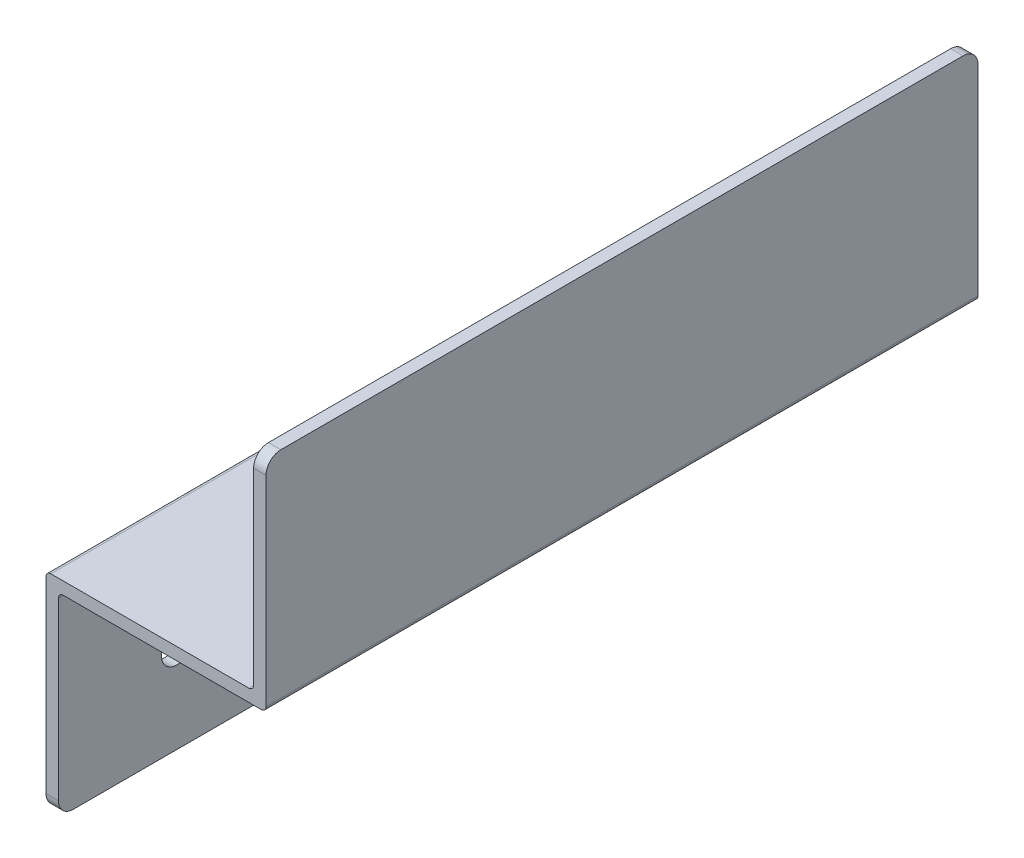
ISO-10303-21;
HEADER;
FILE_DESCRIPTION(('STEP AP214'),'2;1');
FILE_NAME('part.step','',(''),(''),'','','');
FILE_SCHEMA(('AUTOMOTIVE_DESIGN { 1 0 10303 214 1 1 1 1 }'));
ENDSEC;
DATA;
#1=APPLICATION_CONTEXT('core data for automotive mechanical design processes');
#2=APPLICATION_PROTOCOL_DEFINITION('international standard','automotive_design',2000,#1);
#3=PRODUCT_CONTEXT('',#1,'mechanical');
#4=PRODUCT('Part','Part','',(#3));
#5=PRODUCT_RELATED_PRODUCT_CATEGORY('part','',(#4));
#6=PRODUCT_DEFINITION_FORMATION('','',#4);
#7=PRODUCT_DEFINITION_CONTEXT('part definition',#1,'design');
#8=PRODUCT_DEFINITION('design','',#6,#7);
#9=PRODUCT_DEFINITION_SHAPE('','',#8);
#10=(LENGTH_UNIT() NAMED_UNIT(*) SI_UNIT(.MILLI.,.METRE.));
#11=(NAMED_UNIT(*) PLANE_ANGLE_UNIT() SI_UNIT($,.RADIAN.));
#12=(NAMED_UNIT(*) SI_UNIT($,.STERADIAN.) SOLID_ANGLE_UNIT());
#13=UNCERTAINTY_MEASURE_WITH_UNIT(LENGTH_MEASURE(1.E-05),#10,'distance_accuracy_value','');
#14=(GEOMETRIC_REPRESENTATION_CONTEXT(3) GLOBAL_UNCERTAINTY_ASSIGNED_CONTEXT((#13)) GLOBAL_UNIT_ASSIGNED_CONTEXT((#10,
#11,#12)) REPRESENTATION_CONTEXT('',''));
#15=CARTESIAN_POINT('',(0.,0.,0.));
#16=DIRECTION('',(0.,0.,1.));
#17=DIRECTION('',(1.,0.,0.));
#18=AXIS2_PLACEMENT_3D('',#15,#16,#17);
#19=CARTESIAN_POINT('',(1.0414,43.4086,274.86864));
#20=DIRECTION('',(0.,0.,-1.));
#21=DIRECTION('',(-1.,0.,0.));
#22=AXIS2_PLACEMENT_3D('',#19,#20,#21);
#23=CYLINDRICAL_SURFACE('',#22,1.0414);
#24=DIRECTION('',(0.,0.,1.));
#25=VECTOR('',#24,1.);
#26=CARTESIAN_POINT('',(1.0414,44.45,-76.2));
#27=LINE('',#26,#25);
#28=CARTESIAN_POINT('',(1.0414,44.45,-76.2));
#29=VERTEX_POINT('',#28);
#30=CARTESIAN_POINT('',(1.0414,44.45,76.2));
#31=VERTEX_POINT('',#30);
#32=EDGE_CURVE('E132',#29,#31,#27,.T.);
#33=ORIENTED_EDGE('',*,*,#32,.F.);
#34=CARTESIAN_POINT('',(1.0414,43.4086,-76.2));
#35=DIRECTION('',(0.,0.,-1.));
#36=DIRECTION('',(-1.,0.,0.));
#37=AXIS2_PLACEMENT_3D('',#34,#35,#36);
#38=CIRCLE('',#37,1.0414);
#39=CARTESIAN_POINT('',(0.,43.4086,-76.2));
#40=VERTEX_POINT('',#39);
#41=EDGE_CURVE('E137',#29,#40,#38,.F.);
#42=ORIENTED_EDGE('',*,*,#41,.T.);
#43=DIRECTION('',(0.,0.,1.));
#44=VECTOR('',#43,1.);
#45=CARTESIAN_POINT('',(0.,43.4086,-76.2));
#46=LINE('',#45,#44);
#47=CARTESIAN_POINT('',(0.,43.4086,76.2));
#48=VERTEX_POINT('',#47);
#49=EDGE_CURVE('E135',#48,#40,#46,.F.);
#50=ORIENTED_EDGE('',*,*,#49,.F.);
#51=CARTESIAN_POINT('',(1.0414,43.4086,76.2));
#52=DIRECTION('',(0.,0.,-1.));
#53=DIRECTION('',(-1.,0.,0.));
#54=AXIS2_PLACEMENT_3D('',#51,#52,#53);
#55=CIRCLE('',#54,1.0414);
#56=EDGE_CURVE('E20',#48,#31,#55,.T.);
#57=ORIENTED_EDGE('',*,*,#56,.T.);
#58=EDGE_LOOP('',(#33,#42,#50,#57));
#59=FACE_BOUND('',#58,.T.);
#60=ADVANCED_FACE('F17',(#59),#23,.T.);
#61=CARTESIAN_POINT('',(0.,0.,-76.2));
#62=DIRECTION('',(0.,-1.,0.));
#63=DIRECTION('',(0.,0.,-1.));
#64=AXIS2_PLACEMENT_3D('',#61,#62,#63);
#65=PLANE('',#64);
#66=DIRECTION('',(0.,0.,-1.));
#67=VECTOR('',#66,1.);
#68=CARTESIAN_POINT('',(2.65684,0.,-76.2));
#69=LINE('',#68,#67);
#70=CARTESIAN_POINT('',(2.65684,0.,73.025));
#71=VERTEX_POINT('',#70);
#72=CARTESIAN_POINT('',(2.65684,0.,-73.025));
#73=VERTEX_POINT('',#72);
#74=EDGE_CURVE('E173',#71,#73,#69,.T.);
#75=ORIENTED_EDGE('',*,*,#74,.F.);
#76=DIRECTION('',(1.,0.,0.));
#77=VECTOR('',#76,1.);
#78=CARTESIAN_POINT('',(-61.408476624,0.,73.025));
#79=LINE('',#78,#77);
#80=CARTESIAN_POINT('',(0.,0.,73.025));
#81=VERTEX_POINT('',#80);
#82=EDGE_CURVE('E191',#81,#71,#79,.T.);
#83=ORIENTED_EDGE('',*,*,#82,.F.);
#84=DIRECTION('',(0.,0.,1.));
#85=VECTOR('',#84,1.);
#86=CARTESIAN_POINT('',(0.,0.,-76.2));
#87=LINE('',#86,#85);
#88=CARTESIAN_POINT('',(0.,0.,-73.025));
#89=VERTEX_POINT('',#88);
#90=EDGE_CURVE('E186',#89,#81,#87,.T.);
#91=ORIENTED_EDGE('',*,*,#90,.F.);
#92=DIRECTION('',(-1.,0.,0.));
#93=VECTOR('',#92,1.);
#94=CARTESIAN_POINT('',(108.515316624,0.,-73.025));
#95=LINE('',#94,#93);
#96=EDGE_CURVE('E200',#73,#89,#95,.T.);
#97=ORIENTED_EDGE('',*,*,#96,.F.);
#98=EDGE_LOOP('',(#75,#83,#91,#97));
#99=FACE_BOUND('',#98,.T.);
#100=ADVANCED_FACE('F465',(#99),#65,.T.);
#101=CARTESIAN_POINT('',(2.65684,19.05,-50.8));
#102=DIRECTION('',(1.,0.,0.));
#103=DIRECTION('',(0.,0.,-1.));
#104=AXIS2_PLACEMENT_3D('',#101,#102,#103);
#105=CYLINDRICAL_SURFACE('',#104,3.3655);
#106=CARTESIAN_POINT('',(0.,19.05,-50.8));
#107=DIRECTION('',(1.,0.,0.));
#108=DIRECTION('',(0.,0.,-1.));
#109=AXIS2_PLACEMENT_3D('',#106,#107,#108);
#110=CIRCLE('',#109,3.3655);
#111=CARTESIAN_POINT('',(0.,19.05,-54.1655));
#112=VERTEX_POINT('',#111);
#113=EDGE_CURVE('E234',#112,#112,#110,.T.);
#114=ORIENTED_EDGE('',*,*,#113,.F.);
#115=EDGE_LOOP('',(#114));
#116=FACE_BOUND('',#115,.T.);
#117=CARTESIAN_POINT('',(2.65684,19.05,-50.8));
#118=DIRECTION('',(1.,0.,0.));
#119=DIRECTION('',(0.,0.,-1.));
#120=AXIS2_PLACEMENT_3D('',#117,#118,#119);
#121=CIRCLE('',#120,3.3655);
#122=CARTESIAN_POINT('',(2.65684,19.05,-54.1655));
#123=VERTEX_POINT('',#122);
#124=EDGE_CURVE('E223',#123,#123,#121,.F.);
#125=ORIENTED_EDGE('',*,*,#124,.F.);
#126=EDGE_LOOP('',(#125));
#127=FACE_BOUND('',#126,.T.);
#128=ADVANCED_FACE('F455',(#116,#127),#105,.F.);
#129=CARTESIAN_POINT('',(2.65684,19.05,50.8));
#130=DIRECTION('',(1.,0.,0.));
#131=DIRECTION('',(0.,0.,-1.));
#132=AXIS2_PLACEMENT_3D('',#129,#130,#131);
#133=CYLINDRICAL_SURFACE('',#132,3.3655);
#134=CARTESIAN_POINT('',(0.,19.05,50.8));
#135=DIRECTION('',(1.,0.,0.));
#136=DIRECTION('',(0.,0.,-1.));
#137=AXIS2_PLACEMENT_3D('',#134,#135,#136);
#138=CIRCLE('',#137,3.3655);
#139=CARTESIAN_POINT('',(0.,19.05,47.4345));
#140=VERTEX_POINT('',#139);
#141=EDGE_CURVE('E202',#140,#140,#138,.T.);
#142=ORIENTED_EDGE('',*,*,#141,.F.);
#143=EDGE_LOOP('',(#142));
#144=FACE_BOUND('',#143,.T.);
#145=CARTESIAN_POINT('',(2.65684,19.05,50.8));
#146=DIRECTION('',(1.,0.,0.));
#147=DIRECTION('',(0.,0.,-1.));
#148=AXIS2_PLACEMENT_3D('',#145,#146,#147);
#149=CIRCLE('',#148,3.3655);
#150=CARTESIAN_POINT('',(2.65684,19.05,47.4345));
#151=VERTEX_POINT('',#150);
#152=EDGE_CURVE('E172',#151,#151,#149,.F.);
#153=ORIENTED_EDGE('',*,*,#152,.F.);
#154=EDGE_LOOP('',(#153));
#155=FACE_BOUND('',#154,.T.);
#156=ADVANCED_FACE('F446',(#144,#155),#133,.F.);
#157=CARTESIAN_POINT('',(3.69824,40.75176,-274.86864));
#158=DIRECTION('',(0.,0.,1.));
#159=DIRECTION('',(1.,0.,0.));
#160=AXIS2_PLACEMENT_3D('',#157,#158,#159);
#161=CYLINDRICAL_SURFACE('',#160,1.0414);
#162=DIRECTION('',(0.,0.,-1.));
#163=VECTOR('',#162,1.);
#164=CARTESIAN_POINT('',(2.65684,40.75176,-76.2));
#165=LINE('',#164,#163);
#166=CARTESIAN_POINT('',(2.65684,40.75176,-76.2));
#167=VERTEX_POINT('',#166);
#168=CARTESIAN_POINT('',(2.65684,40.75176,76.2));
#169=VERTEX_POINT('',#168);
#170=EDGE_CURVE('E182',#167,#169,#165,.F.);
#171=ORIENTED_EDGE('',*,*,#170,.F.);
#172=CARTESIAN_POINT('',(3.69824,40.75176,-76.2));
#173=DIRECTION('',(0.,0.,1.));
#174=DIRECTION('',(1.,0.,0.));
#175=AXIS2_PLACEMENT_3D('',#172,#173,#174);
#176=CIRCLE('',#175,1.0414);
#177=CARTESIAN_POINT('',(3.69824,41.79316,-76.2));
#178=VERTEX_POINT('',#177);
#179=EDGE_CURVE('E243',#178,#167,#176,.T.);
#180=ORIENTED_EDGE('',*,*,#179,.F.);
#181=DIRECTION('',(0.,0.,-1.));
#182=VECTOR('',#181,1.);
#183=CARTESIAN_POINT('',(3.69824,41.79316,-76.2));
#184=LINE('',#183,#182);
#185=CARTESIAN_POINT('',(3.69824,41.79316,76.2));
#186=VERTEX_POINT('',#185);
#187=EDGE_CURVE('E169',#186,#178,#184,.T.);
#188=ORIENTED_EDGE('',*,*,#187,.F.);
#189=CARTESIAN_POINT('',(3.69824,40.75176,76.2));
#190=DIRECTION('',(0.,0.,1.));
#191=DIRECTION('',(1.,0.,0.));
#192=AXIS2_PLACEMENT_3D('',#189,#190,#191);
#193=CIRCLE('',#192,1.0414);
#194=EDGE_CURVE('E241',#169,#186,#193,.F.);
#195=ORIENTED_EDGE('',*,*,#194,.F.);
#196=EDGE_LOOP('',(#171,#180,#188,#195));
#197=FACE_BOUND('',#196,.T.);
#198=ADVANCED_FACE('F272',(#197),#161,.F.);
#199=CARTESIAN_POINT('',(43.4086,45.4914,-274.86864));
#200=DIRECTION('',(0.,0.,1.));
#201=DIRECTION('',(1.,0.,0.));
#202=AXIS2_PLACEMENT_3D('',#199,#200,#201);
#203=CYLINDRICAL_SURFACE('',#202,1.0414);
#204=DIRECTION('',(0.,0.,1.));
#205=VECTOR('',#204,1.);
#206=CARTESIAN_POINT('',(44.45,45.4914,-76.2));
#207=LINE('',#206,#205);
#208=CARTESIAN_POINT('',(44.45,45.4914,-76.2));
#209=VERTEX_POINT('',#208);
#210=CARTESIAN_POINT('',(44.45,45.4914,76.2));
#211=VERTEX_POINT('',#210);
#212=EDGE_CURVE('E156',#209,#211,#207,.T.);
#213=ORIENTED_EDGE('',*,*,#212,.F.);
#214=CARTESIAN_POINT('',(43.4086,45.4914,-76.2));
#215=DIRECTION('',(0.,0.,1.));
#216=DIRECTION('',(1.,0.,0.));
#217=AXIS2_PLACEMENT_3D('',#214,#215,#216);
#218=CIRCLE('',#217,1.0414);
#219=CARTESIAN_POINT('',(43.4086,44.45,-76.2));
#220=VERTEX_POINT('',#219);
#221=EDGE_CURVE('E239',#220,#209,#218,.T.);
#222=ORIENTED_EDGE('',*,*,#221,.F.);
#223=DIRECTION('',(0.,0.,1.));
#224=VECTOR('',#223,1.);
#225=CARTESIAN_POINT('',(43.4086,44.45,-76.2));
#226=LINE('',#225,#224);
#227=CARTESIAN_POINT('',(43.4086,44.45,76.2));
#228=VERTEX_POINT('',#227);
#229=EDGE_CURVE('E145',#228,#220,#226,.F.);
#230=ORIENTED_EDGE('',*,*,#229,.F.);
#231=CARTESIAN_POINT('',(43.4086,45.4914,76.2));
#232=DIRECTION('',(0.,0.,1.));
#233=DIRECTION('',(1.,0.,0.));
#234=AXIS2_PLACEMENT_3D('',#231,#232,#233);
#235=CIRCLE('',#234,1.0414);
#236=EDGE_CURVE('E149',#211,#228,#235,.F.);
#237=ORIENTED_EDGE('',*,*,#236,.F.);
#238=EDGE_LOOP('',(#213,#222,#230,#237));
#239=FACE_BOUND('',#238,.T.);
#240=ADVANCED_FACE('F427',(#239),#203,.F.);
#241=CARTESIAN_POINT('',(-61.408476624,3.175,73.025));
#242=DIRECTION('',(1.,0.,0.));
#243=DIRECTION('',(0.,0.,-1.));
#244=AXIS2_PLACEMENT_3D('',#241,#242,#243);
#245=CYLINDRICAL_SURFACE('',#244,3.175);
#246=ORIENTED_EDGE('',*,*,#82,.T.);
#247=CARTESIAN_POINT('',(2.65684,3.175,73.025));
#248=DIRECTION('',(1.,0.,0.));
#249=DIRECTION('',(0.,0.,-1.));
#250=AXIS2_PLACEMENT_3D('',#247,#248,#249);
#251=CIRCLE('',#250,3.175);
#252=CARTESIAN_POINT('',(2.65684,3.175,76.2));
#253=VERTEX_POINT('',#252);
#254=EDGE_CURVE('E185',#253,#71,#251,.T.);
#255=ORIENTED_EDGE('',*,*,#254,.F.);
#256=DIRECTION('',(1.,0.,0.));
#257=VECTOR('',#256,1.);
#258=CARTESIAN_POINT('',(0.,3.175,76.2));
#259=LINE('',#258,#257);
#260=CARTESIAN_POINT('',(0.,3.175,76.2));
#261=VERTEX_POINT('',#260);
#262=EDGE_CURVE('E154',#261,#253,#259,.T.);
#263=ORIENTED_EDGE('',*,*,#262,.F.);
#264=CARTESIAN_POINT('',(0.,3.175,73.025));
#265=DIRECTION('',(1.,0.,0.));
#266=DIRECTION('',(0.,0.,-1.));
#267=AXIS2_PLACEMENT_3D('',#264,#265,#266);
#268=CIRCLE('',#267,3.175);
#269=EDGE_CURVE('E189',#81,#261,#268,.F.);
#270=ORIENTED_EDGE('',*,*,#269,.F.);
#271=EDGE_LOOP('',(#246,#255,#263,#270));
#272=FACE_BOUND('',#271,.T.);
#273=ADVANCED_FACE('F418',(#272),#245,.T.);
#274=CARTESIAN_POINT('',(44.45,44.45,-76.2));
#275=DIRECTION('',(0.,1.,0.));
#276=DIRECTION('',(0.,0.,1.));
#277=AXIS2_PLACEMENT_3D('',#274,#275,#276);
#278=PLANE('',#277);
#279=DIRECTION('',(1.,0.,0.));
#280=VECTOR('',#279,1.);
#281=CARTESIAN_POINT('',(0.,44.45,-76.2));
#282=LINE('',#281,#280);
#283=EDGE_CURVE('E144',#220,#29,#282,.F.);
#284=ORIENTED_EDGE('',*,*,#283,.T.);
#285=ORIENTED_EDGE('',*,*,#32,.T.);
#286=DIRECTION('',(1.,0.,0.));
#287=VECTOR('',#286,1.);
#288=CARTESIAN_POINT('',(0.,44.45,76.2));
#289=LINE('',#288,#287);
#290=EDGE_CURVE('E142',#228,#31,#289,.F.);
#291=ORIENTED_EDGE('',*,*,#290,.F.);
#292=ORIENTED_EDGE('',*,*,#229,.T.);
#293=EDGE_LOOP('',(#284,#285,#291,#292));
#294=FACE_BOUND('',#293,.T.);
#295=ADVANCED_FACE('F140',(#294),#278,.T.);
#296=CARTESIAN_POINT('',(0.,44.45,-76.2));
#297=DIRECTION('',(-1.,0.,0.));
#298=DIRECTION('',(0.,0.,1.));
#299=AXIS2_PLACEMENT_3D('',#296,#297,#298);
#300=PLANE('',#299);
#301=ORIENTED_EDGE('',*,*,#141,.T.);
#302=EDGE_LOOP('',(#301));
#303=FACE_BOUND('',#302,.T.);
#304=ORIENTED_EDGE('',*,*,#113,.T.);
#305=EDGE_LOOP('',(#304));
#306=FACE_BOUND('',#305,.T.);
#307=ORIENTED_EDGE('',*,*,#90,.T.);
#308=ORIENTED_EDGE('',*,*,#269,.T.);
#309=DIRECTION('',(0.,1.,0.));
#310=VECTOR('',#309,1.);
#311=CARTESIAN_POINT('',(0.,0.,76.2));
#312=LINE('',#311,#310);
#313=EDGE_CURVE('E151',#48,#261,#312,.F.);
#314=ORIENTED_EDGE('',*,*,#313,.F.);
#315=ORIENTED_EDGE('',*,*,#49,.T.);
#316=DIRECTION('',(0.,1.,0.));
#317=VECTOR('',#316,1.);
#318=CARTESIAN_POINT('',(0.,0.,-76.2));
#319=LINE('',#318,#317);
#320=CARTESIAN_POINT('',(0.,3.175,-76.2));
#321=VERTEX_POINT('',#320);
#322=EDGE_CURVE('E181',#40,#321,#319,.F.);
#323=ORIENTED_EDGE('',*,*,#322,.T.);
#324=CARTESIAN_POINT('',(0.,3.175,-73.025));
#325=DIRECTION('',(-1.,0.,0.));
#326=DIRECTION('',(0.,0.,1.));
#327=AXIS2_PLACEMENT_3D('',#324,#325,#326);
#328=CIRCLE('',#327,3.175);
#329=EDGE_CURVE('E177',#89,#321,#328,.F.);
#330=ORIENTED_EDGE('',*,*,#329,.F.);
#331=EDGE_LOOP('',(#307,#308,#314,#315,#323,#330));
#332=FACE_BOUND('',#331,.T.);
#333=ADVANCED_FACE('F247',(#303,#306,#332),#300,.T.);
#334=CARTESIAN_POINT('',(108.515316624,3.175,-73.025));
#335=DIRECTION('',(-1.,0.,0.));
#336=DIRECTION('',(0.,0.,1.));
#337=AXIS2_PLACEMENT_3D('',#334,#335,#336);
#338=CYLINDRICAL_SURFACE('',#337,3.175);
#339=ORIENTED_EDGE('',*,*,#96,.T.);
#340=ORIENTED_EDGE('',*,*,#329,.T.);
#341=DIRECTION('',(1.,0.,0.));
#342=VECTOR('',#341,1.);
#343=CARTESIAN_POINT('',(0.,3.175,-76.2));
#344=LINE('',#343,#342);
#345=CARTESIAN_POINT('',(2.65684,3.175,-76.2));
#346=VERTEX_POINT('',#345);
#347=EDGE_CURVE('E178',#321,#346,#344,.T.);
#348=ORIENTED_EDGE('',*,*,#347,.T.);
#349=CARTESIAN_POINT('',(2.65683999999999,3.175,-73.025));
#350=DIRECTION('',(-1.,0.,0.));
#351=DIRECTION('',(0.,0.,1.));
#352=AXIS2_PLACEMENT_3D('',#349,#350,#351);
#353=CIRCLE('',#352,3.175);
#354=EDGE_CURVE('E176',#73,#346,#353,.F.);
#355=ORIENTED_EDGE('',*,*,#354,.F.);
#356=EDGE_LOOP('',(#339,#340,#348,#355));
#357=FACE_BOUND('',#356,.T.);
#358=ADVANCED_FACE('F390',(#357),#338,.T.);
#359=CARTESIAN_POINT('',(2.65684,0.,-76.2));
#360=DIRECTION('',(1.,0.,0.));
#361=DIRECTION('',(0.,0.,-1.));
#362=AXIS2_PLACEMENT_3D('',#359,#360,#361);
#363=PLANE('',#362);
#364=ORIENTED_EDGE('',*,*,#152,.T.);
#365=EDGE_LOOP('',(#364));
#366=FACE_BOUND('',#365,.T.);
#367=ORIENTED_EDGE('',*,*,#124,.T.);
#368=EDGE_LOOP('',(#367));
#369=FACE_BOUND('',#368,.T.);
#370=DIRECTION('',(0.,1.,0.));
#371=VECTOR('',#370,1.);
#372=CARTESIAN_POINT('',(2.65684,0.,76.2));
#373=LINE('',#372,#371);
#374=EDGE_CURVE('E197',#253,#169,#373,.T.);
#375=ORIENTED_EDGE('',*,*,#374,.F.);
#376=ORIENTED_EDGE('',*,*,#254,.T.);
#377=ORIENTED_EDGE('',*,*,#74,.T.);
#378=ORIENTED_EDGE('',*,*,#354,.T.);
#379=DIRECTION('',(0.,1.,0.));
#380=VECTOR('',#379,1.);
#381=CARTESIAN_POINT('',(2.65684,0.,-76.2));
#382=LINE('',#381,#380);
#383=EDGE_CURVE('E180',#346,#167,#382,.T.);
#384=ORIENTED_EDGE('',*,*,#383,.T.);
#385=ORIENTED_EDGE('',*,*,#170,.T.);
#386=EDGE_LOOP('',(#375,#376,#377,#378,#384,#385));
#387=FACE_BOUND('',#386,.T.);
#388=ADVANCED_FACE('F268',(#366,#369,#387),#363,.T.);
#389=CARTESIAN_POINT('',(2.65684,41.79316,-76.2));
#390=DIRECTION('',(0.,-1.,0.));
#391=DIRECTION('',(0.,0.,-1.));
#392=AXIS2_PLACEMENT_3D('',#389,#390,#391);
#393=PLANE('',#392);
#394=DIRECTION('',(1.,0.,0.));
#395=VECTOR('',#394,1.);
#396=CARTESIAN_POINT('',(0.,41.79316,-76.2));
#397=LINE('',#396,#395);
#398=CARTESIAN_POINT('',(46.06544,41.79316,-76.2));
#399=VERTEX_POINT('',#398);
#400=EDGE_CURVE('E217',#178,#399,#397,.T.);
#401=ORIENTED_EDGE('',*,*,#400,.T.);
#402=DIRECTION('',(0.,0.,-1.));
#403=VECTOR('',#402,1.);
#404=CARTESIAN_POINT('',(46.06544,41.79316,274.86864));
#405=LINE('',#404,#403);
#406=CARTESIAN_POINT('',(46.06544,41.79316,76.2));
#407=VERTEX_POINT('',#406);
#408=EDGE_CURVE('E164',#407,#399,#405,.T.);
#409=ORIENTED_EDGE('',*,*,#408,.F.);
#410=DIRECTION('',(1.,0.,0.));
#411=VECTOR('',#410,1.);
#412=CARTESIAN_POINT('',(0.,41.79316,76.2));
#413=LINE('',#412,#411);
#414=EDGE_CURVE('E220',#186,#407,#413,.T.);
#415=ORIENTED_EDGE('',*,*,#414,.F.);
#416=ORIENTED_EDGE('',*,*,#187,.T.);
#417=EDGE_LOOP('',(#401,#409,#415,#416));
#418=FACE_BOUND('',#417,.T.);
#419=ADVANCED_FACE('F277',(#418),#393,.T.);
#420=CARTESIAN_POINT('',(44.45,88.9,-76.2));
#421=DIRECTION('',(-1.,0.,0.));
#422=DIRECTION('',(0.,0.,1.));
#423=AXIS2_PLACEMENT_3D('',#420,#421,#422);
#424=PLANE('',#423);
#425=DIRECTION('',(0.,1.,0.));
#426=VECTOR('',#425,1.);
#427=CARTESIAN_POINT('',(44.45,0.,76.2));
#428=LINE('',#427,#426);
#429=CARTESIAN_POINT('',(44.45,85.725,76.2));
#430=VERTEX_POINT('',#429);
#431=EDGE_CURVE('E152',#430,#211,#428,.F.);
#432=ORIENTED_EDGE('',*,*,#431,.F.);
#433=CARTESIAN_POINT('',(44.45,85.725,73.025));
#434=DIRECTION('',(-1.,0.,0.));
#435=DIRECTION('',(0.,0.,1.));
#436=AXIS2_PLACEMENT_3D('',#433,#434,#435);
#437=CIRCLE('',#436,3.175);
#438=CARTESIAN_POINT('',(44.45,88.9,73.025));
#439=VERTEX_POINT('',#438);
#440=EDGE_CURVE('E208',#439,#430,#437,.F.);
#441=ORIENTED_EDGE('',*,*,#440,.F.);
#442=DIRECTION('',(0.,0.,1.));
#443=VECTOR('',#442,1.);
#444=CARTESIAN_POINT('',(44.45,88.9,-76.2));
#445=LINE('',#444,#443);
#446=CARTESIAN_POINT('',(44.45,88.9,-73.025));
#447=VERTEX_POINT('',#446);
#448=EDGE_CURVE('E160',#447,#439,#445,.T.);
#449=ORIENTED_EDGE('',*,*,#448,.F.);
#450=CARTESIAN_POINT('',(44.45,85.725,-73.025));
#451=DIRECTION('',(1.,0.,0.));
#452=DIRECTION('',(0.,0.,-1.));
#453=AXIS2_PLACEMENT_3D('',#450,#451,#452);
#454=CIRCLE('',#453,3.175);
#455=CARTESIAN_POINT('',(44.45,85.725,-76.2));
#456=VERTEX_POINT('',#455);
#457=EDGE_CURVE('E212',#456,#447,#454,.T.);
#458=ORIENTED_EDGE('',*,*,#457,.F.);
#459=DIRECTION('',(0.,1.,0.));
#460=VECTOR('',#459,1.);
#461=CARTESIAN_POINT('',(44.45,0.,-76.2));
#462=LINE('',#461,#460);
#463=EDGE_CURVE('E167',#456,#209,#462,.F.);
#464=ORIENTED_EDGE('',*,*,#463,.T.);
#465=ORIENTED_EDGE('',*,*,#212,.T.);
#466=EDGE_LOOP('',(#432,#441,#449,#458,#464,#465));
#467=FACE_BOUND('',#466,.T.);
#468=ADVANCED_FACE('F364',(#467),#424,.T.);
#469=CARTESIAN_POINT('',(0.,0.,76.2));
#470=DIRECTION('',(0.,0.,1.));
#471=DIRECTION('',(1.,0.,0.));
#472=AXIS2_PLACEMENT_3D('',#469,#470,#471);
#473=PLANE('',#472);
#474=DIRECTION('',(0.,1.,0.));
#475=VECTOR('',#474,1.);
#476=CARTESIAN_POINT('',(47.10684,41.79316,76.2));
#477=LINE('',#476,#475);
#478=CARTESIAN_POINT('',(47.10684,85.725,76.2));
#479=VERTEX_POINT('',#478);
#480=CARTESIAN_POINT('',(47.10684,42.83456,76.2));
#481=VERTEX_POINT('',#480);
#482=EDGE_CURVE('E211',#479,#481,#477,.F.);
#483=ORIENTED_EDGE('',*,*,#482,.F.);
#484=DIRECTION('',(-1.,0.,0.));
#485=VECTOR('',#484,1.);
#486=CARTESIAN_POINT('',(108.515316624,85.725,76.2));
#487=LINE('',#486,#485);
#488=EDGE_CURVE('E162',#430,#479,#487,.F.);
#489=ORIENTED_EDGE('',*,*,#488,.F.);
#490=ORIENTED_EDGE('',*,*,#431,.T.);
#491=ORIENTED_EDGE('',*,*,#236,.T.);
#492=ORIENTED_EDGE('',*,*,#290,.T.);
#493=ORIENTED_EDGE('',*,*,#56,.F.);
#494=ORIENTED_EDGE('',*,*,#313,.T.);
#495=ORIENTED_EDGE('',*,*,#262,.T.);
#496=ORIENTED_EDGE('',*,*,#374,.T.);
#497=ORIENTED_EDGE('',*,*,#194,.T.);
#498=ORIENTED_EDGE('',*,*,#414,.T.);
#499=CARTESIAN_POINT('',(46.06544,42.83456,76.2));
#500=DIRECTION('',(0.,0.,-1.));
#501=DIRECTION('',(-1.,0.,0.));
#502=AXIS2_PLACEMENT_3D('',#499,#500,#501);
#503=CIRCLE('',#502,1.0414);
#504=EDGE_CURVE('E168',#481,#407,#503,.T.);
#505=ORIENTED_EDGE('',*,*,#504,.F.);
#506=EDGE_LOOP('',(#483,#489,#490,#491,#492,#493,#494,#495,#496,#497,#498,#505));
#507=FACE_BOUND('',#506,.T.);
#508=ADVANCED_FACE('F147',(#507),#473,.T.);
#509=CARTESIAN_POINT('',(46.06544,42.83456,274.86864));
#510=DIRECTION('',(0.,0.,-1.));
#511=DIRECTION('',(-1.,0.,0.));
#512=AXIS2_PLACEMENT_3D('',#509,#510,#511);
#513=CYLINDRICAL_SURFACE('',#512,1.0414);
#514=ORIENTED_EDGE('',*,*,#408,.T.);
#515=CARTESIAN_POINT('',(46.06544,42.83456,-76.2));
#516=DIRECTION('',(0.,0.,-1.));
#517=DIRECTION('',(-1.,0.,0.));
#518=AXIS2_PLACEMENT_3D('',#515,#516,#517);
#519=CIRCLE('',#518,1.0414);
#520=CARTESIAN_POINT('',(47.10684,42.83456,-76.2));
#521=VERTEX_POINT('',#520);
#522=EDGE_CURVE('E215',#399,#521,#519,.F.);
#523=ORIENTED_EDGE('',*,*,#522,.T.);
#524=DIRECTION('',(0.,0.,-1.));
#525=VECTOR('',#524,1.);
#526=CARTESIAN_POINT('',(47.10684,42.83456,-76.2));
#527=LINE('',#526,#525);
#528=EDGE_CURVE('E260',#481,#521,#527,.T.);
#529=ORIENTED_EDGE('',*,*,#528,.F.);
#530=ORIENTED_EDGE('',*,*,#504,.T.);
#531=EDGE_LOOP('',(#514,#523,#529,#530));
#532=FACE_BOUND('',#531,.T.);
#533=ADVANCED_FACE('F283',(#532),#513,.T.);
#534=CARTESIAN_POINT('',(0.,0.,-76.2));
#535=DIRECTION('',(0.,0.,1.));
#536=DIRECTION('',(1.,0.,0.));
#537=AXIS2_PLACEMENT_3D('',#534,#535,#536);
#538=PLANE('',#537);
#539=ORIENTED_EDGE('',*,*,#522,.F.);
#540=ORIENTED_EDGE('',*,*,#400,.F.);
#541=ORIENTED_EDGE('',*,*,#179,.T.);
#542=ORIENTED_EDGE('',*,*,#383,.F.);
#543=ORIENTED_EDGE('',*,*,#347,.F.);
#544=ORIENTED_EDGE('',*,*,#322,.F.);
#545=ORIENTED_EDGE('',*,*,#41,.F.);
#546=ORIENTED_EDGE('',*,*,#283,.F.);
#547=ORIENTED_EDGE('',*,*,#221,.T.);
#548=ORIENTED_EDGE('',*,*,#463,.F.);
#549=DIRECTION('',(1.,0.,0.));
#550=VECTOR('',#549,1.);
#551=CARTESIAN_POINT('',(-61.408476624,85.725,-76.2));
#552=LINE('',#551,#550);
#553=CARTESIAN_POINT('',(47.10684,85.725,-76.2));
#554=VERTEX_POINT('',#553);
#555=EDGE_CURVE('E214',#554,#456,#552,.F.);
#556=ORIENTED_EDGE('',*,*,#555,.F.);
#557=DIRECTION('',(0.,1.,0.));
#558=VECTOR('',#557,1.);
#559=CARTESIAN_POINT('',(47.10684,41.79316,-76.2));
#560=LINE('',#559,#558);
#561=EDGE_CURVE('E207',#521,#554,#560,.T.);
#562=ORIENTED_EDGE('',*,*,#561,.F.);
#563=EDGE_LOOP('',(#539,#540,#541,#542,#543,#544,#545,#546,#547,#548,#556,#562));
#564=FACE_BOUND('',#563,.T.);
#565=ADVANCED_FACE('F251',(#564),#538,.F.);
#566=CARTESIAN_POINT('',(-61.408476624,85.725,-73.025));
#567=DIRECTION('',(1.,0.,0.));
#568=DIRECTION('',(0.,0.,-1.));
#569=AXIS2_PLACEMENT_3D('',#566,#567,#568);
#570=CYLINDRICAL_SURFACE('',#569,3.175);
#571=DIRECTION('',(1.,0.,0.));
#572=VECTOR('',#571,1.);
#573=CARTESIAN_POINT('',(47.10684,88.9,-73.025));
#574=LINE('',#573,#572);
#575=CARTESIAN_POINT('',(47.10684,88.9,-73.025));
#576=VERTEX_POINT('',#575);
#577=EDGE_CURVE('E163',#576,#447,#574,.F.);
#578=ORIENTED_EDGE('',*,*,#577,.F.);
#579=CARTESIAN_POINT('',(47.10684,85.725,-73.025));
#580=DIRECTION('',(1.,0.,0.));
#581=DIRECTION('',(0.,0.,-1.));
#582=AXIS2_PLACEMENT_3D('',#579,#580,#581);
#583=CIRCLE('',#582,3.175);
#584=EDGE_CURVE('E204',#554,#576,#583,.T.);
#585=ORIENTED_EDGE('',*,*,#584,.F.);
#586=ORIENTED_EDGE('',*,*,#555,.T.);
#587=ORIENTED_EDGE('',*,*,#457,.T.);
#588=EDGE_LOOP('',(#578,#585,#586,#587));
#589=FACE_BOUND('',#588,.T.);
#590=ADVANCED_FACE('F300',(#589),#570,.T.);
#591=CARTESIAN_POINT('',(47.10684,88.9,-76.2));
#592=DIRECTION('',(0.,1.,0.));
#593=DIRECTION('',(0.,0.,1.));
#594=AXIS2_PLACEMENT_3D('',#591,#592,#593);
#595=PLANE('',#594);
#596=ORIENTED_EDGE('',*,*,#448,.T.);
#597=DIRECTION('',(-1.,0.,0.));
#598=VECTOR('',#597,1.);
#599=CARTESIAN_POINT('',(108.515316624,88.9,73.025));
#600=LINE('',#599,#598);
#601=CARTESIAN_POINT('',(47.10684,88.9,73.025));
#602=VERTEX_POINT('',#601);
#603=EDGE_CURVE('E35',#602,#439,#600,.T.);
#604=ORIENTED_EDGE('',*,*,#603,.F.);
#605=DIRECTION('',(0.,0.,-1.));
#606=VECTOR('',#605,1.);
#607=CARTESIAN_POINT('',(47.10684,88.9,-76.2));
#608=LINE('',#607,#606);
#609=EDGE_CURVE('E26',#576,#602,#608,.F.);
#610=ORIENTED_EDGE('',*,*,#609,.F.);
#611=ORIENTED_EDGE('',*,*,#577,.T.);
#612=EDGE_LOOP('',(#596,#604,#610,#611));
#613=FACE_BOUND('',#612,.T.);
#614=ADVANCED_FACE('F303',(#613),#595,.T.);
#615=CARTESIAN_POINT('',(108.515316624,85.725,73.025));
#616=DIRECTION('',(-1.,0.,0.));
#617=DIRECTION('',(0.,0.,1.));
#618=AXIS2_PLACEMENT_3D('',#615,#616,#617);
#619=CYLINDRICAL_SURFACE('',#618,3.175);
#620=ORIENTED_EDGE('',*,*,#603,.T.);
#621=ORIENTED_EDGE('',*,*,#440,.T.);
#622=ORIENTED_EDGE('',*,*,#488,.T.);
#623=CARTESIAN_POINT('',(47.10684,85.725,73.025));
#624=DIRECTION('',(-1.,0.,0.));
#625=DIRECTION('',(0.,0.,1.));
#626=AXIS2_PLACEMENT_3D('',#623,#624,#625);
#627=CIRCLE('',#626,3.175);
#628=EDGE_CURVE('E11',#602,#479,#627,.F.);
#629=ORIENTED_EDGE('',*,*,#628,.F.);
#630=EDGE_LOOP('',(#620,#621,#622,#629));
#631=FACE_BOUND('',#630,.T.);
#632=ADVANCED_FACE('F306',(#631),#619,.T.);
#633=CARTESIAN_POINT('',(47.10684,41.79316,-76.2));
#634=DIRECTION('',(1.,0.,0.));
#635=DIRECTION('',(0.,0.,-1.));
#636=AXIS2_PLACEMENT_3D('',#633,#634,#635);
#637=PLANE('',#636);
#638=ORIENTED_EDGE('',*,*,#609,.T.);
#639=ORIENTED_EDGE('',*,*,#628,.T.);
#640=ORIENTED_EDGE('',*,*,#482,.T.);
#641=ORIENTED_EDGE('',*,*,#528,.T.);
#642=ORIENTED_EDGE('',*,*,#561,.T.);
#643=ORIENTED_EDGE('',*,*,#584,.T.);
#644=EDGE_LOOP('',(#638,#639,#640,#641,#642,#643));
#645=FACE_BOUND('',#644,.T.);
#646=ADVANCED_FACE('F288',(#645),#637,.T.);
#647=CLOSED_SHELL('',(#60,#100,#128,#156,#198,#240,#273,#295,#333,#358,#388,#419,#468,#508,#533,
#565,#590,#614,#632,#646));
#648=MANIFOLD_SOLID_BREP('B1',#647);
#649=ADVANCED_BREP_SHAPE_REPRESENTATION('',(#18,#648),#14);
#650=SHAPE_DEFINITION_REPRESENTATION(#9,#649);
ENDSEC;
END-ISO-10303-21;
